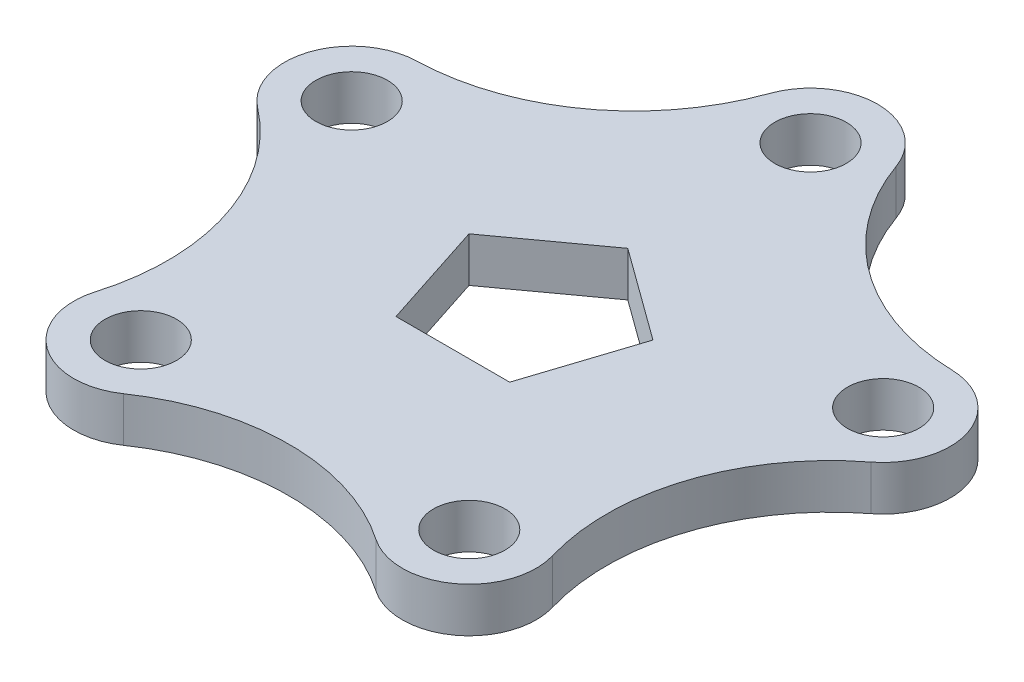
ISO-10303-21;
HEADER;
FILE_DESCRIPTION(('STEP AP214'),'2;1');
FILE_NAME('part.step','',(''),(''),'','','');
FILE_SCHEMA(('AUTOMOTIVE_DESIGN { 1 0 10303 214 1 1 1 1 }'));
ENDSEC;
DATA;
#1=APPLICATION_CONTEXT('core data for automotive mechanical design processes');
#2=APPLICATION_PROTOCOL_DEFINITION('international standard','automotive_design',2000,#1);
#3=PRODUCT_CONTEXT('',#1,'mechanical');
#4=PRODUCT('Part','Part','',(#3));
#5=PRODUCT_RELATED_PRODUCT_CATEGORY('part','',(#4));
#6=PRODUCT_DEFINITION_FORMATION('','',#4);
#7=PRODUCT_DEFINITION_CONTEXT('part definition',#1,'design');
#8=PRODUCT_DEFINITION('design','',#6,#7);
#9=PRODUCT_DEFINITION_SHAPE('','',#8);
#10=(LENGTH_UNIT() NAMED_UNIT(*) SI_UNIT(.MILLI.,.METRE.));
#11=(NAMED_UNIT(*) PLANE_ANGLE_UNIT() SI_UNIT($,.RADIAN.));
#12=(NAMED_UNIT(*) SI_UNIT($,.STERADIAN.) SOLID_ANGLE_UNIT());
#13=UNCERTAINTY_MEASURE_WITH_UNIT(LENGTH_MEASURE(1.E-05),#10,'distance_accuracy_value','');
#14=(GEOMETRIC_REPRESENTATION_CONTEXT(3) GLOBAL_UNCERTAINTY_ASSIGNED_CONTEXT((#13)) GLOBAL_UNIT_ASSIGNED_CONTEXT((#10,
#11,#12)) REPRESENTATION_CONTEXT('',''));
#15=CARTESIAN_POINT('',(0.,0.,0.));
#16=DIRECTION('',(0.,0.,1.));
#17=DIRECTION('',(1.,0.,0.));
#18=AXIS2_PLACEMENT_3D('',#15,#16,#17);
#19=CARTESIAN_POINT('',(60.340172157842,5.,-51.8011220361711));
#20=DIRECTION('',(0.,1.,0.));
#21=DIRECTION('',(0.,0.,1.));
#22=AXIS2_PLACEMENT_3D('',#19,#20,#21);
#23=PLANE('',#22);
#24=CARTESIAN_POINT('',(-36.73657826828,5.,50.5635621484339));
#25=DIRECTION('',(0.,1.,0.));
#26=DIRECTION('',(0.,0.,1.));
#27=AXIS2_PLACEMENT_3D('',#24,#25,#26);
#28=CIRCLE('',#27,8.00000000000001);
#29=CARTESIAN_POINT('',(-36.73657826828,5.,58.5635621484339));
#30=VERTEX_POINT('',#29);
#31=EDGE_CURVE('E618',#30,#30,#28,.T.);
#32=ORIENTED_EDGE('',*,*,#31,.F.);
#33=EDGE_LOOP('',(#32));
#34=FACE_BOUND('',#33,.T.);
#35=CARTESIAN_POINT('',(59.4410322684472,5.,-19.313562148434));
#36=DIRECTION('',(0.,1.,0.));
#37=DIRECTION('',(0.,0.,1.));
#38=AXIS2_PLACEMENT_3D('',#35,#36,#37);
#39=CIRCLE('',#38,8.00000000000001);
#40=CARTESIAN_POINT('',(59.4410322684472,5.,-11.313562148434));
#41=VERTEX_POINT('',#40);
#42=EDGE_CURVE('E190',#41,#41,#39,.T.);
#43=ORIENTED_EDGE('',*,*,#42,.F.);
#44=EDGE_LOOP('',(#43));
#45=FACE_BOUND('',#44,.T.);
#46=CARTESIAN_POINT('',(61.2393120472368,5.,-84.2886819239081));
#47=DIRECTION('',(0.,-1.,0.));
#48=DIRECTION('',(0.,0.,1.));
#49=AXIS2_PLACEMENT_3D('',#46,#47,#48);
#50=CIRCLE('',#49,50.0000000000003);
#51=CARTESIAN_POINT('',(59.8560199097063,5.,-34.3078205581589));
#52=VERTEX_POINT('',#51);
#53=CARTESIAN_POINT('',(14.1321489339776,5.,-67.5281573670557));
#54=VERTEX_POINT('',#53);
#55=EDGE_CURVE('E221',#52,#54,#50,.T.);
#56=ORIENTED_EDGE('',*,*,#55,.T.);
#57=CARTESIAN_POINT('',(0.,5.,-62.5));
#58=DIRECTION('',(0.,1.,0.));
#59=DIRECTION('',(0.,0.,1.));
#60=AXIS2_PLACEMENT_3D('',#57,#58,#59);
#61=CIRCLE('',#60,15.0000000000001);
#62=CARTESIAN_POINT('',(-14.1321489339776,5.,-67.5281573670559));
#63=VERTEX_POINT('',#62);
#64=EDGE_CURVE('E225',#54,#63,#61,.T.);
#65=ORIENTED_EDGE('',*,*,#64,.T.);
#66=CARTESIAN_POINT('',(-61.2393120472359,5.,-84.2886819239087));
#67=DIRECTION('',(0.,-1.,0.));
#68=DIRECTION('',(0.,0.,1.));
#69=AXIS2_PLACEMENT_3D('',#66,#67,#68);
#70=CIRCLE('',#69,49.9999999999999);
#71=CARTESIAN_POINT('',(-59.8560199097059,5.,-34.3078205581597));
#72=VERTEX_POINT('',#71);
#73=EDGE_CURVE('E229',#63,#72,#70,.T.);
#74=ORIENTED_EDGE('',*,*,#73,.T.);
#75=CARTESIAN_POINT('',(-59.4410322684469,5.,-19.3135621484349));
#76=DIRECTION('',(0.,1.,0.));
#77=DIRECTION('',(0.,0.,1.));
#78=AXIS2_PLACEMENT_3D('',#75,#76,#77);
#79=CIRCLE('',#78,15.);
#80=CARTESIAN_POINT('',(-68.5901682849797,5.,-7.4268758923341));
#81=VERTEX_POINT('',#80);
#82=EDGE_CURVE('E232',#72,#81,#79,.T.);
#83=ORIENTED_EDGE('',*,*,#82,.T.);
#84=CARTESIAN_POINT('',(-99.0872883400896,5.,32.1954116280026));
#85=DIRECTION('',(0.,-1.,0.));
#86=DIRECTION('',(0.,0.,1.));
#87=AXIS2_PLACEMENT_3D('',#84,#85,#86);
#88=CIRCLE('',#87,50.0000000000002);
#89=CARTESIAN_POINT('',(-51.1252036694668,5.,46.3247581821805));
#90=VERTEX_POINT('',#89);
#91=EDGE_CURVE('E235',#81,#90,#88,.T.);
#92=ORIENTED_EDGE('',*,*,#91,.T.);
#93=CARTESIAN_POINT('',(-36.73657826828,5.,50.5635621484339));
#94=DIRECTION('',(0.,1.,0.));
#95=DIRECTION('',(0.,0.,1.));
#96=AXIS2_PLACEMENT_3D('',#93,#94,#95);
#97=CIRCLE('',#96,15.0000000000001);
#98=CARTESIAN_POINT('',(-28.2589063602158,5.,62.9380956353663));
#99=VERTEX_POINT('',#98);
#100=EDGE_CURVE('E238',#90,#99,#97,.T.);
#101=ORIENTED_EDGE('',*,*,#100,.T.);
#102=CARTESIAN_POINT('',(-1.31838984174237E-12,5.,104.186540591809));
#103=DIRECTION('',(0.,-1.,0.));
#104=DIRECTION('',(0.,0.,1.));
#105=AXIS2_PLACEMENT_3D('',#102,#103,#104);
#106=CIRCLE('',#105,50.0000000000002);
#107=CARTESIAN_POINT('',(28.2589063602146,5.,62.9380956353669));
#108=VERTEX_POINT('',#107);
#109=EDGE_CURVE('E241',#99,#108,#106,.T.);
#110=ORIENTED_EDGE('',*,*,#109,.T.);
#111=CARTESIAN_POINT('',(36.7365782682793,5.,50.5635621484344));
#112=DIRECTION('',(0.,1.,0.));
#113=DIRECTION('',(0.,0.,1.));
#114=AXIS2_PLACEMENT_3D('',#111,#112,#113);
#115=CIRCLE('',#114,15.0000000000001);
#116=CARTESIAN_POINT('',(51.1252036694658,5.,46.3247581821816));
#117=VERTEX_POINT('',#116);
#118=EDGE_CURVE('E244',#108,#117,#115,.T.);
#119=ORIENTED_EDGE('',*,*,#118,.T.);
#120=CARTESIAN_POINT('',(99.0872883400888,5.,32.1954116280051));
#121=DIRECTION('',(0.,-1.,0.));
#122=DIRECTION('',(0.,0.,1.));
#123=AXIS2_PLACEMENT_3D('',#120,#121,#122);
#124=CIRCLE('',#123,50.0000000000002);
#125=CARTESIAN_POINT('',(68.5901682849798,5.,-7.42687589233277));
#126=VERTEX_POINT('',#125);
#127=EDGE_CURVE('E247',#117,#126,#124,.T.);
#128=ORIENTED_EDGE('',*,*,#127,.T.);
#129=CARTESIAN_POINT('',(59.4410322684472,5.,-19.313562148434));
#130=DIRECTION('',(0.,1.,0.));
#131=DIRECTION('',(0.,0.,1.));
#132=AXIS2_PLACEMENT_3D('',#129,#130,#131);
#133=CIRCLE('',#132,15.0000000000001);
#134=EDGE_CURVE('E250',#126,#52,#133,.T.);
#135=ORIENTED_EDGE('',*,*,#134,.T.);
#136=EDGE_LOOP('',(#56,#65,#74,#83,#92,#101,#110,#119,#128,#135));
#137=FACE_BOUND('',#136,.T.);
#138=CARTESIAN_POINT('',(0.,5.,-62.5));
#139=DIRECTION('',(0.,1.,0.));
#140=DIRECTION('',(0.,0.,1.));
#141=AXIS2_PLACEMENT_3D('',#138,#139,#140);
#142=CIRCLE('',#141,8.);
#143=CARTESIAN_POINT('',(0.,5.,-54.5));
#144=VERTEX_POINT('',#143);
#145=EDGE_CURVE('E213',#144,#144,#142,.T.);
#146=ORIENTED_EDGE('',*,*,#145,.F.);
#147=EDGE_LOOP('',(#146));
#148=FACE_BOUND('',#147,.T.);
#149=DIRECTION('',(-0.809016994374947,0.,0.587785252292473));
#150=VECTOR('',#149,1.);
#151=CARTESIAN_POINT('',(0.,5.,-21.6311896062463));
#152=LINE('',#151,#150);
#153=CARTESIAN_POINT('',(0.,5.,-21.6311896062463));
#154=VERTEX_POINT('',#153);
#155=CARTESIAN_POINT('',(-20.5724838302366,5.,-6.68440519687684));
#156=VERTEX_POINT('',#155);
#157=EDGE_CURVE('E160',#154,#156,#152,.T.);
#158=ORIENTED_EDGE('',*,*,#157,.F.);
#159=DIRECTION('',(-0.809016994374947,0.,-0.587785252292473));
#160=VECTOR('',#159,1.);
#161=CARTESIAN_POINT('',(20.5724838302366,5.,-6.68440519687684));
#162=LINE('',#161,#160);
#163=CARTESIAN_POINT('',(20.5724838302366,5.,-6.68440519687684));
#164=VERTEX_POINT('',#163);
#165=EDGE_CURVE('E151',#164,#154,#162,.T.);
#166=ORIENTED_EDGE('',*,*,#165,.F.);
#167=DIRECTION('',(0.309016994374948,0.,-0.951056516295154));
#168=VECTOR('',#167,1.);
#169=CARTESIAN_POINT('',(12.7144942400938,5.,17.5));
#170=LINE('',#169,#168);
#171=CARTESIAN_POINT('',(12.7144942400938,5.,17.5));
#172=VERTEX_POINT('',#171);
#173=EDGE_CURVE('E185',#172,#164,#170,.T.);
#174=ORIENTED_EDGE('',*,*,#173,.F.);
#175=DIRECTION('',(1.,0.,0.));
#176=VECTOR('',#175,1.);
#177=CARTESIAN_POINT('',(-12.7144942400938,5.,17.5));
#178=LINE('',#177,#176);
#179=CARTESIAN_POINT('',(-12.7144942400938,5.,17.5));
#180=VERTEX_POINT('',#179);
#181=EDGE_CURVE('E179',#180,#172,#178,.T.);
#182=ORIENTED_EDGE('',*,*,#181,.F.);
#183=DIRECTION('',(0.309016994374948,0.,0.951056516295154));
#184=VECTOR('',#183,1.);
#185=CARTESIAN_POINT('',(-20.5724838302366,5.,-6.68440519687684));
#186=LINE('',#185,#184);
#187=EDGE_CURVE('E175',#156,#180,#186,.T.);
#188=ORIENTED_EDGE('',*,*,#187,.F.);
#189=EDGE_LOOP('',(#158,#166,#174,#182,#188));
#190=FACE_BOUND('',#189,.T.);
#191=CARTESIAN_POINT('',(36.7365782682793,5.,50.5635621484344));
#192=DIRECTION('',(0.,1.,0.));
#193=DIRECTION('',(0.,0.,1.));
#194=AXIS2_PLACEMENT_3D('',#191,#192,#193);
#195=CIRCLE('',#194,8.);
#196=CARTESIAN_POINT('',(36.7365782682793,5.,58.5635621484344));
#197=VERTEX_POINT('',#196);
#198=EDGE_CURVE('E626',#197,#197,#195,.T.);
#199=ORIENTED_EDGE('',*,*,#198,.F.);
#200=EDGE_LOOP('',(#199));
#201=FACE_BOUND('',#200,.T.);
#202=CARTESIAN_POINT('',(-59.4410322684469,5.,-19.3135621484349));
#203=DIRECTION('',(0.,1.,0.));
#204=DIRECTION('',(0.,0.,1.));
#205=AXIS2_PLACEMENT_3D('',#202,#203,#204);
#206=CIRCLE('',#205,8.);
#207=CARTESIAN_POINT('',(-59.4410322684469,5.,-11.3135621484349));
#208=VERTEX_POINT('',#207);
#209=EDGE_CURVE('E607',#208,#208,#206,.T.);
#210=ORIENTED_EDGE('',*,*,#209,.F.);
#211=EDGE_LOOP('',(#210));
#212=FACE_BOUND('',#211,.T.);
#213=ADVANCED_FACE('F43',(#34,#45,#137,#148,#190,#201,#212),#23,.T.);
#214=CARTESIAN_POINT('',(60.340172157842,-5.,-51.8011220361711));
#215=DIRECTION('',(0.,1.,0.));
#216=DIRECTION('',(0.,0.,1.));
#217=AXIS2_PLACEMENT_3D('',#214,#215,#216);
#218=PLANE('',#217);
#219=CARTESIAN_POINT('',(0.,-5.,-62.5));
#220=DIRECTION('',(0.,1.,0.));
#221=DIRECTION('',(0.,0.,1.));
#222=AXIS2_PLACEMENT_3D('',#219,#220,#221);
#223=CIRCLE('',#222,8.);
#224=CARTESIAN_POINT('',(0.,-5.,-54.5));
#225=VERTEX_POINT('',#224);
#226=EDGE_CURVE('E169',#225,#225,#223,.T.);
#227=ORIENTED_EDGE('',*,*,#226,.T.);
#228=EDGE_LOOP('',(#227));
#229=FACE_BOUND('',#228,.T.);
#230=CARTESIAN_POINT('',(61.2393120472368,-5.,-84.2886819239081));
#231=DIRECTION('',(0.,-1.,0.));
#232=DIRECTION('',(0.,0.,1.));
#233=AXIS2_PLACEMENT_3D('',#230,#231,#232);
#234=CIRCLE('',#233,50.0000000000003);
#235=CARTESIAN_POINT('',(59.8560199097063,-5.,-34.3078205581589));
#236=VERTEX_POINT('',#235);
#237=CARTESIAN_POINT('',(14.1321489339776,-5.,-67.5281573670557));
#238=VERTEX_POINT('',#237);
#239=EDGE_CURVE('E217',#236,#238,#234,.T.);
#240=ORIENTED_EDGE('',*,*,#239,.F.);
#241=CARTESIAN_POINT('',(59.4410322684472,-5.,-19.313562148434));
#242=DIRECTION('',(0.,1.,0.));
#243=DIRECTION('',(0.,0.,1.));
#244=AXIS2_PLACEMENT_3D('',#241,#242,#243);
#245=CIRCLE('',#244,15.0000000000001);
#246=CARTESIAN_POINT('',(68.5901682849798,-5.,-7.42687589233277));
#247=VERTEX_POINT('',#246);
#248=EDGE_CURVE('E226',#247,#236,#245,.T.);
#249=ORIENTED_EDGE('',*,*,#248,.F.);
#250=CARTESIAN_POINT('',(99.0872883400888,-5.,32.1954116280051));
#251=DIRECTION('',(0.,-1.,0.));
#252=DIRECTION('',(0.,0.,1.));
#253=AXIS2_PLACEMENT_3D('',#250,#251,#252);
#254=CIRCLE('',#253,50.0000000000002);
#255=CARTESIAN_POINT('',(51.1252036694658,-5.,46.3247581821816));
#256=VERTEX_POINT('',#255);
#257=EDGE_CURVE('E278',#256,#247,#254,.T.);
#258=ORIENTED_EDGE('',*,*,#257,.F.);
#259=CARTESIAN_POINT('',(36.7365782682793,-5.,50.5635621484344));
#260=DIRECTION('',(0.,1.,0.));
#261=DIRECTION('',(0.,0.,1.));
#262=AXIS2_PLACEMENT_3D('',#259,#260,#261);
#263=CIRCLE('',#262,15.0000000000001);
#264=CARTESIAN_POINT('',(28.2589063602146,-5.,62.9380956353669));
#265=VERTEX_POINT('',#264);
#266=EDGE_CURVE('E275',#265,#256,#263,.T.);
#267=ORIENTED_EDGE('',*,*,#266,.F.);
#268=CARTESIAN_POINT('',(-1.31838984174237E-12,-5.,104.186540591809));
#269=DIRECTION('',(0.,-1.,0.));
#270=DIRECTION('',(0.,0.,1.));
#271=AXIS2_PLACEMENT_3D('',#268,#269,#270);
#272=CIRCLE('',#271,50.0000000000002);
#273=CARTESIAN_POINT('',(-28.2589063602158,-5.,62.9380956353663));
#274=VERTEX_POINT('',#273);
#275=EDGE_CURVE('E272',#274,#265,#272,.T.);
#276=ORIENTED_EDGE('',*,*,#275,.F.);
#277=CARTESIAN_POINT('',(-36.73657826828,-5.,50.5635621484339));
#278=DIRECTION('',(0.,1.,0.));
#279=DIRECTION('',(0.,0.,1.));
#280=AXIS2_PLACEMENT_3D('',#277,#278,#279);
#281=CIRCLE('',#280,15.0000000000001);
#282=CARTESIAN_POINT('',(-51.1252036694668,-5.,46.3247581821805));
#283=VERTEX_POINT('',#282);
#284=EDGE_CURVE('E269',#283,#274,#281,.T.);
#285=ORIENTED_EDGE('',*,*,#284,.F.);
#286=CARTESIAN_POINT('',(-99.0872883400896,-5.,32.1954116280026));
#287=DIRECTION('',(0.,-1.,0.));
#288=DIRECTION('',(0.,0.,1.));
#289=AXIS2_PLACEMENT_3D('',#286,#287,#288);
#290=CIRCLE('',#289,50.0000000000002);
#291=CARTESIAN_POINT('',(-68.5901682849797,-5.,-7.4268758923341));
#292=VERTEX_POINT('',#291);
#293=EDGE_CURVE('E266',#292,#283,#290,.T.);
#294=ORIENTED_EDGE('',*,*,#293,.F.);
#295=CARTESIAN_POINT('',(-59.4410322684469,-5.,-19.3135621484349));
#296=DIRECTION('',(0.,1.,0.));
#297=DIRECTION('',(0.,0.,1.));
#298=AXIS2_PLACEMENT_3D('',#295,#296,#297);
#299=CIRCLE('',#298,15.);
#300=CARTESIAN_POINT('',(-59.8560199097059,-5.,-34.3078205581597));
#301=VERTEX_POINT('',#300);
#302=EDGE_CURVE('E263',#301,#292,#299,.T.);
#303=ORIENTED_EDGE('',*,*,#302,.F.);
#304=CARTESIAN_POINT('',(-61.2393120472359,-5.,-84.2886819239087));
#305=DIRECTION('',(0.,-1.,0.));
#306=DIRECTION('',(0.,0.,1.));
#307=AXIS2_PLACEMENT_3D('',#304,#305,#306);
#308=CIRCLE('',#307,49.9999999999999);
#309=CARTESIAN_POINT('',(-14.1321489339776,-5.,-67.5281573670559));
#310=VERTEX_POINT('',#309);
#311=EDGE_CURVE('E260',#310,#301,#308,.T.);
#312=ORIENTED_EDGE('',*,*,#311,.F.);
#313=CARTESIAN_POINT('',(0.,-5.,-62.5));
#314=DIRECTION('',(0.,1.,0.));
#315=DIRECTION('',(0.,0.,1.));
#316=AXIS2_PLACEMENT_3D('',#313,#314,#315);
#317=CIRCLE('',#316,15.0000000000001);
#318=EDGE_CURVE('E257',#238,#310,#317,.T.);
#319=ORIENTED_EDGE('',*,*,#318,.F.);
#320=EDGE_LOOP('',(#240,#249,#258,#267,#276,#285,#294,#303,#312,#319));
#321=FACE_BOUND('',#320,.T.);
#322=DIRECTION('',(-0.809016994374947,0.,-0.587785252292473));
#323=VECTOR('',#322,1.);
#324=CARTESIAN_POINT('',(20.5724838302366,-5.,-6.68440519687684));
#325=LINE('',#324,#323);
#326=CARTESIAN_POINT('',(20.5724838302366,-5.,-6.68440519687684));
#327=VERTEX_POINT('',#326);
#328=CARTESIAN_POINT('',(0.,-5.,-21.6311896062463));
#329=VERTEX_POINT('',#328);
#330=EDGE_CURVE('E67',#327,#329,#325,.T.);
#331=ORIENTED_EDGE('',*,*,#330,.T.);
#332=DIRECTION('',(-0.809016994374947,0.,0.587785252292473));
#333=VECTOR('',#332,1.);
#334=CARTESIAN_POINT('',(0.,-5.,-21.6311896062463));
#335=LINE('',#334,#333);
#336=CARTESIAN_POINT('',(-20.5724838302366,-5.,-6.68440519687684));
#337=VERTEX_POINT('',#336);
#338=EDGE_CURVE('E167',#329,#337,#335,.T.);
#339=ORIENTED_EDGE('',*,*,#338,.T.);
#340=DIRECTION('',(0.309016994374948,0.,0.951056516295154));
#341=VECTOR('',#340,1.);
#342=CARTESIAN_POINT('',(-20.5724838302366,-5.,-6.68440519687684));
#343=LINE('',#342,#341);
#344=CARTESIAN_POINT('',(-12.7144942400938,-5.,17.5));
#345=VERTEX_POINT('',#344);
#346=EDGE_CURVE('E193',#337,#345,#343,.T.);
#347=ORIENTED_EDGE('',*,*,#346,.T.);
#348=DIRECTION('',(1.,0.,0.));
#349=VECTOR('',#348,1.);
#350=CARTESIAN_POINT('',(-12.7144942400938,-5.,17.5));
#351=LINE('',#350,#349);
#352=CARTESIAN_POINT('',(12.7144942400938,-5.,17.5));
#353=VERTEX_POINT('',#352);
#354=EDGE_CURVE('E197',#345,#353,#351,.T.);
#355=ORIENTED_EDGE('',*,*,#354,.T.);
#356=DIRECTION('',(0.309016994374948,0.,-0.951056516295154));
#357=VECTOR('',#356,1.);
#358=CARTESIAN_POINT('',(12.7144942400938,-5.,17.5));
#359=LINE('',#358,#357);
#360=EDGE_CURVE('E161',#353,#327,#359,.T.);
#361=ORIENTED_EDGE('',*,*,#360,.T.);
#362=EDGE_LOOP('',(#331,#339,#347,#355,#361));
#363=FACE_BOUND('',#362,.T.);
#364=CARTESIAN_POINT('',(59.4410322684472,-5.,-19.313562148434));
#365=DIRECTION('',(0.,1.,0.));
#366=DIRECTION('',(0.,0.,1.));
#367=AXIS2_PLACEMENT_3D('',#364,#365,#366);
#368=CIRCLE('',#367,8.00000000000001);
#369=CARTESIAN_POINT('',(59.4410322684472,-5.,-11.313562148434));
#370=VERTEX_POINT('',#369);
#371=EDGE_CURVE('E630',#370,#370,#368,.T.);
#372=ORIENTED_EDGE('',*,*,#371,.T.);
#373=EDGE_LOOP('',(#372));
#374=FACE_BOUND('',#373,.T.);
#375=CARTESIAN_POINT('',(36.7365782682793,-5.,50.5635621484344));
#376=DIRECTION('',(0.,1.,0.));
#377=DIRECTION('',(0.,0.,1.));
#378=AXIS2_PLACEMENT_3D('',#375,#376,#377);
#379=CIRCLE('',#378,8.);
#380=CARTESIAN_POINT('',(36.7365782682793,-5.,58.5635621484344));
#381=VERTEX_POINT('',#380);
#382=EDGE_CURVE('E622',#381,#381,#379,.T.);
#383=ORIENTED_EDGE('',*,*,#382,.T.);
#384=EDGE_LOOP('',(#383));
#385=FACE_BOUND('',#384,.T.);
#386=CARTESIAN_POINT('',(-36.73657826828,-5.,50.5635621484339));
#387=DIRECTION('',(0.,1.,0.));
#388=DIRECTION('',(0.,0.,1.));
#389=AXIS2_PLACEMENT_3D('',#386,#387,#388);
#390=CIRCLE('',#389,8.00000000000001);
#391=CARTESIAN_POINT('',(-36.73657826828,-5.,58.5635621484339));
#392=VERTEX_POINT('',#391);
#393=EDGE_CURVE('E615',#392,#392,#390,.T.);
#394=ORIENTED_EDGE('',*,*,#393,.T.);
#395=EDGE_LOOP('',(#394));
#396=FACE_BOUND('',#395,.T.);
#397=CARTESIAN_POINT('',(-59.4410322684469,-5.,-19.3135621484349));
#398=DIRECTION('',(0.,1.,0.));
#399=DIRECTION('',(0.,0.,1.));
#400=AXIS2_PLACEMENT_3D('',#397,#398,#399);
#401=CIRCLE('',#400,8.);
#402=CARTESIAN_POINT('',(-59.4410322684469,-5.,-11.3135621484349));
#403=VERTEX_POINT('',#402);
#404=EDGE_CURVE('E610',#403,#403,#401,.T.);
#405=ORIENTED_EDGE('',*,*,#404,.T.);
#406=EDGE_LOOP('',(#405));
#407=FACE_BOUND('',#406,.T.);
#408=ADVANCED_FACE('F325',(#229,#321,#363,#374,#385,#396,#407),#218,.F.);
#409=CARTESIAN_POINT('',(61.2393120472368,5.,-84.2886819239081));
#410=DIRECTION('',(0.,-1.,0.));
#411=DIRECTION('',(0.,0.,-1.));
#412=AXIS2_PLACEMENT_3D('',#409,#410,#411);
#413=CYLINDRICAL_SURFACE('',#412,50.0000000000003);
#414=ORIENTED_EDGE('',*,*,#239,.T.);
#415=DIRECTION('',(0.,-1.,0.));
#416=VECTOR('',#415,1.);
#417=CARTESIAN_POINT('',(14.1321489339776,5.,-67.5281573670557));
#418=LINE('',#417,#416);
#419=EDGE_CURVE('E11',#54,#238,#418,.T.);
#420=ORIENTED_EDGE('',*,*,#419,.F.);
#421=ORIENTED_EDGE('',*,*,#55,.F.);
#422=DIRECTION('',(0.,-1.,0.));
#423=VECTOR('',#422,1.);
#424=CARTESIAN_POINT('',(59.8560199097063,5.,-34.3078205581589));
#425=LINE('',#424,#423);
#426=EDGE_CURVE('E253',#52,#236,#425,.T.);
#427=ORIENTED_EDGE('',*,*,#426,.T.);
#428=EDGE_LOOP('',(#414,#420,#421,#427));
#429=FACE_BOUND('',#428,.T.);
#430=ADVANCED_FACE('F45',(#429),#413,.F.);
#431=CARTESIAN_POINT('',(0.,5.,-62.5));
#432=DIRECTION('',(0.,-1.,0.));
#433=DIRECTION('',(0.,0.,-1.));
#434=AXIS2_PLACEMENT_3D('',#431,#432,#433);
#435=CYLINDRICAL_SURFACE('',#434,15.0000000000001);
#436=ORIENTED_EDGE('',*,*,#318,.T.);
#437=DIRECTION('',(0.,-1.,0.));
#438=VECTOR('',#437,1.);
#439=CARTESIAN_POINT('',(-14.1321489339776,5.,-67.5281573670559));
#440=LINE('',#439,#438);
#441=EDGE_CURVE('E52',#63,#310,#440,.T.);
#442=ORIENTED_EDGE('',*,*,#441,.F.);
#443=ORIENTED_EDGE('',*,*,#64,.F.);
#444=ORIENTED_EDGE('',*,*,#419,.T.);
#445=EDGE_LOOP('',(#436,#442,#443,#444));
#446=FACE_BOUND('',#445,.T.);
#447=ADVANCED_FACE('F343',(#446),#435,.T.);
#448=CARTESIAN_POINT('',(-61.2393120472359,5.,-84.2886819239087));
#449=DIRECTION('',(0.,-1.,0.));
#450=DIRECTION('',(0.,0.,-1.));
#451=AXIS2_PLACEMENT_3D('',#448,#449,#450);
#452=CYLINDRICAL_SURFACE('',#451,49.9999999999999);
#453=ORIENTED_EDGE('',*,*,#311,.T.);
#454=DIRECTION('',(0.,-1.,0.));
#455=VECTOR('',#454,1.);
#456=CARTESIAN_POINT('',(-59.8560199097059,5.,-34.3078205581597));
#457=LINE('',#456,#455);
#458=EDGE_CURVE('E310',#72,#301,#457,.T.);
#459=ORIENTED_EDGE('',*,*,#458,.F.);
#460=ORIENTED_EDGE('',*,*,#73,.F.);
#461=ORIENTED_EDGE('',*,*,#441,.T.);
#462=EDGE_LOOP('',(#453,#459,#460,#461));
#463=FACE_BOUND('',#462,.T.);
#464=ADVANCED_FACE('F319',(#463),#452,.F.);
#465=CARTESIAN_POINT('',(-59.4410322684469,5.,-19.3135621484349));
#466=DIRECTION('',(0.,-1.,0.));
#467=DIRECTION('',(0.,0.,-1.));
#468=AXIS2_PLACEMENT_3D('',#465,#466,#467);
#469=CYLINDRICAL_SURFACE('',#468,15.);
#470=ORIENTED_EDGE('',*,*,#302,.T.);
#471=DIRECTION('',(0.,-1.,0.));
#472=VECTOR('',#471,1.);
#473=CARTESIAN_POINT('',(-68.5901682849797,5.,-7.4268758923341));
#474=LINE('',#473,#472);
#475=EDGE_CURVE('E306',#81,#292,#474,.T.);
#476=ORIENTED_EDGE('',*,*,#475,.F.);
#477=ORIENTED_EDGE('',*,*,#82,.F.);
#478=ORIENTED_EDGE('',*,*,#458,.T.);
#479=EDGE_LOOP('',(#470,#476,#477,#478));
#480=FACE_BOUND('',#479,.T.);
#481=ADVANCED_FACE('F331',(#480),#469,.T.);
#482=CARTESIAN_POINT('',(-99.0872883400896,5.,32.1954116280026));
#483=DIRECTION('',(0.,-1.,0.));
#484=DIRECTION('',(0.,0.,-1.));
#485=AXIS2_PLACEMENT_3D('',#482,#483,#484);
#486=CYLINDRICAL_SURFACE('',#485,50.0000000000002);
#487=ORIENTED_EDGE('',*,*,#293,.T.);
#488=DIRECTION('',(0.,-1.,0.));
#489=VECTOR('',#488,1.);
#490=CARTESIAN_POINT('',(-51.1252036694668,5.,46.3247581821805));
#491=LINE('',#490,#489);
#492=EDGE_CURVE('E302',#90,#283,#491,.T.);
#493=ORIENTED_EDGE('',*,*,#492,.F.);
#494=ORIENTED_EDGE('',*,*,#91,.F.);
#495=ORIENTED_EDGE('',*,*,#475,.T.);
#496=EDGE_LOOP('',(#487,#493,#494,#495));
#497=FACE_BOUND('',#496,.T.);
#498=ADVANCED_FACE('F335',(#497),#486,.F.);
#499=CARTESIAN_POINT('',(-36.73657826828,5.,50.5635621484339));
#500=DIRECTION('',(0.,-1.,0.));
#501=DIRECTION('',(0.,0.,-1.));
#502=AXIS2_PLACEMENT_3D('',#499,#500,#501);
#503=CYLINDRICAL_SURFACE('',#502,15.0000000000001);
#504=ORIENTED_EDGE('',*,*,#284,.T.);
#505=DIRECTION('',(0.,-1.,0.));
#506=VECTOR('',#505,1.);
#507=CARTESIAN_POINT('',(-28.2589063602158,5.,62.9380956353663));
#508=LINE('',#507,#506);
#509=EDGE_CURVE('E298',#99,#274,#508,.T.);
#510=ORIENTED_EDGE('',*,*,#509,.F.);
#511=ORIENTED_EDGE('',*,*,#100,.F.);
#512=ORIENTED_EDGE('',*,*,#492,.T.);
#513=EDGE_LOOP('',(#504,#510,#511,#512));
#514=FACE_BOUND('',#513,.T.);
#515=ADVANCED_FACE('F366',(#514),#503,.T.);
#516=CARTESIAN_POINT('',(-1.31838984174237E-12,5.,104.186540591809));
#517=DIRECTION('',(0.,-1.,0.));
#518=DIRECTION('',(0.,0.,-1.));
#519=AXIS2_PLACEMENT_3D('',#516,#517,#518);
#520=CYLINDRICAL_SURFACE('',#519,50.0000000000002);
#521=ORIENTED_EDGE('',*,*,#275,.T.);
#522=DIRECTION('',(0.,-1.,0.));
#523=VECTOR('',#522,1.);
#524=CARTESIAN_POINT('',(28.2589063602146,5.,62.9380956353669));
#525=LINE('',#524,#523);
#526=EDGE_CURVE('E294',#108,#265,#525,.T.);
#527=ORIENTED_EDGE('',*,*,#526,.F.);
#528=ORIENTED_EDGE('',*,*,#109,.F.);
#529=ORIENTED_EDGE('',*,*,#509,.T.);
#530=EDGE_LOOP('',(#521,#527,#528,#529));
#531=FACE_BOUND('',#530,.T.);
#532=ADVANCED_FACE('F363',(#531),#520,.F.);
#533=CARTESIAN_POINT('',(36.7365782682793,5.,50.5635621484344));
#534=DIRECTION('',(0.,-1.,0.));
#535=DIRECTION('',(0.,0.,-1.));
#536=AXIS2_PLACEMENT_3D('',#533,#534,#535);
#537=CYLINDRICAL_SURFACE('',#536,15.0000000000001);
#538=ORIENTED_EDGE('',*,*,#266,.T.);
#539=DIRECTION('',(0.,-1.,0.));
#540=VECTOR('',#539,1.);
#541=CARTESIAN_POINT('',(51.1252036694658,5.,46.3247581821816));
#542=LINE('',#541,#540);
#543=EDGE_CURVE('E290',#117,#256,#542,.T.);
#544=ORIENTED_EDGE('',*,*,#543,.F.);
#545=ORIENTED_EDGE('',*,*,#118,.F.);
#546=ORIENTED_EDGE('',*,*,#526,.T.);
#547=EDGE_LOOP('',(#538,#544,#545,#546));
#548=FACE_BOUND('',#547,.T.);
#549=ADVANCED_FACE('F359',(#548),#537,.T.);
#550=CARTESIAN_POINT('',(99.0872883400888,5.,32.1954116280051));
#551=DIRECTION('',(0.,-1.,0.));
#552=DIRECTION('',(0.,0.,-1.));
#553=AXIS2_PLACEMENT_3D('',#550,#551,#552);
#554=CYLINDRICAL_SURFACE('',#553,50.0000000000002);
#555=ORIENTED_EDGE('',*,*,#257,.T.);
#556=DIRECTION('',(0.,-1.,0.));
#557=VECTOR('',#556,1.);
#558=CARTESIAN_POINT('',(68.5901682849798,5.,-7.42687589233277));
#559=LINE('',#558,#557);
#560=EDGE_CURVE('E286',#126,#247,#559,.T.);
#561=ORIENTED_EDGE('',*,*,#560,.F.);
#562=ORIENTED_EDGE('',*,*,#127,.F.);
#563=ORIENTED_EDGE('',*,*,#543,.T.);
#564=EDGE_LOOP('',(#555,#561,#562,#563));
#565=FACE_BOUND('',#564,.T.);
#566=ADVANCED_FACE('F355',(#565),#554,.F.);
#567=CARTESIAN_POINT('',(59.4410322684472,5.,-19.313562148434));
#568=DIRECTION('',(0.,-1.,0.));
#569=DIRECTION('',(0.,0.,-1.));
#570=AXIS2_PLACEMENT_3D('',#567,#568,#569);
#571=CYLINDRICAL_SURFACE('',#570,15.0000000000001);
#572=ORIENTED_EDGE('',*,*,#248,.T.);
#573=ORIENTED_EDGE('',*,*,#426,.F.);
#574=ORIENTED_EDGE('',*,*,#134,.F.);
#575=ORIENTED_EDGE('',*,*,#560,.T.);
#576=EDGE_LOOP('',(#572,#573,#574,#575));
#577=FACE_BOUND('',#576,.T.);
#578=ADVANCED_FACE('F350',(#577),#571,.T.);
#579=CARTESIAN_POINT('',(0.,5.,-62.5));
#580=DIRECTION('',(0.,-1.,0.));
#581=DIRECTION('',(0.,0.,-1.));
#582=AXIS2_PLACEMENT_3D('',#579,#580,#581);
#583=CYLINDRICAL_SURFACE('',#582,8.);
#584=ORIENTED_EDGE('',*,*,#145,.T.);
#585=EDGE_LOOP('',(#584));
#586=FACE_BOUND('',#585,.T.);
#587=ORIENTED_EDGE('',*,*,#226,.F.);
#588=EDGE_LOOP('',(#587));
#589=FACE_BOUND('',#588,.T.);
#590=ADVANCED_FACE('F386',(#586,#589),#583,.F.);
#591=CARTESIAN_POINT('',(20.5724838302366,5.,-6.68440519687684));
#592=DIRECTION('',(-0.587785252292473,0.,0.809016994374947));
#593=DIRECTION('',(0.809016994374948,0.,0.587785252292473));
#594=AXIS2_PLACEMENT_3D('',#591,#592,#593);
#595=PLANE('',#594);
#596=ORIENTED_EDGE('',*,*,#330,.F.);
#597=DIRECTION('',(0.,-1.,0.));
#598=VECTOR('',#597,1.);
#599=CARTESIAN_POINT('',(20.5724838302366,5.,-6.68440519687684));
#600=LINE('',#599,#598);
#601=EDGE_CURVE('E155',#164,#327,#600,.T.);
#602=ORIENTED_EDGE('',*,*,#601,.F.);
#603=ORIENTED_EDGE('',*,*,#165,.T.);
#604=DIRECTION('',(0.,-1.,0.));
#605=VECTOR('',#604,1.);
#606=CARTESIAN_POINT('',(0.,5.,-21.6311896062463));
#607=LINE('',#606,#605);
#608=EDGE_CURVE('E154',#154,#329,#607,.T.);
#609=ORIENTED_EDGE('',*,*,#608,.T.);
#610=EDGE_LOOP('',(#596,#602,#603,#609));
#611=FACE_BOUND('',#610,.T.);
#612=ADVANCED_FACE('F153',(#611),#595,.T.);
#613=CARTESIAN_POINT('',(0.,5.,-21.6311896062463));
#614=DIRECTION('',(0.587785252292473,0.,0.809016994374947));
#615=DIRECTION('',(0.809016994374948,0.,-0.587785252292473));
#616=AXIS2_PLACEMENT_3D('',#613,#614,#615);
#617=PLANE('',#616);
#618=ORIENTED_EDGE('',*,*,#338,.F.);
#619=ORIENTED_EDGE('',*,*,#608,.F.);
#620=ORIENTED_EDGE('',*,*,#157,.T.);
#621=DIRECTION('',(0.,-1.,0.));
#622=VECTOR('',#621,1.);
#623=CARTESIAN_POINT('',(-20.5724838302366,5.,-6.68440519687684));
#624=LINE('',#623,#622);
#625=EDGE_CURVE('E170',#156,#337,#624,.T.);
#626=ORIENTED_EDGE('',*,*,#625,.T.);
#627=EDGE_LOOP('',(#618,#619,#620,#626));
#628=FACE_BOUND('',#627,.T.);
#629=ADVANCED_FACE('F164',(#628),#617,.T.);
#630=CARTESIAN_POINT('',(-20.5724838302366,5.,-6.68440519687684));
#631=DIRECTION('',(0.951056516295154,0.,-0.309016994374948));
#632=DIRECTION('',(-0.309016994374948,0.,-0.951056516295154));
#633=AXIS2_PLACEMENT_3D('',#630,#631,#632);
#634=PLANE('',#633);
#635=ORIENTED_EDGE('',*,*,#346,.F.);
#636=ORIENTED_EDGE('',*,*,#625,.F.);
#637=ORIENTED_EDGE('',*,*,#187,.T.);
#638=DIRECTION('',(0.,-1.,0.));
#639=VECTOR('',#638,1.);
#640=CARTESIAN_POINT('',(-12.7144942400938,5.,17.5));
#641=LINE('',#640,#639);
#642=EDGE_CURVE('E208',#180,#345,#641,.T.);
#643=ORIENTED_EDGE('',*,*,#642,.T.);
#644=EDGE_LOOP('',(#635,#636,#637,#643));
#645=FACE_BOUND('',#644,.T.);
#646=ADVANCED_FACE('F423',(#645),#634,.T.);
#647=CARTESIAN_POINT('',(-12.7144942400938,5.,17.5));
#648=DIRECTION('',(0.,0.,-1.));
#649=DIRECTION('',(-1.,0.,0.));
#650=AXIS2_PLACEMENT_3D('',#647,#648,#649);
#651=PLANE('',#650);
#652=ORIENTED_EDGE('',*,*,#354,.F.);
#653=ORIENTED_EDGE('',*,*,#642,.F.);
#654=ORIENTED_EDGE('',*,*,#181,.T.);
#655=DIRECTION('',(0.,-1.,0.));
#656=VECTOR('',#655,1.);
#657=CARTESIAN_POINT('',(12.7144942400938,5.,17.5));
#658=LINE('',#657,#656);
#659=EDGE_CURVE('E59',#172,#353,#658,.T.);
#660=ORIENTED_EDGE('',*,*,#659,.T.);
#661=EDGE_LOOP('',(#652,#653,#654,#660));
#662=FACE_BOUND('',#661,.T.);
#663=ADVANCED_FACE('F430',(#662),#651,.T.);
#664=CARTESIAN_POINT('',(12.7144942400938,5.,17.5));
#665=DIRECTION('',(-0.951056516295154,0.,-0.309016994374948));
#666=DIRECTION('',(-0.309016994374948,0.,0.951056516295154));
#667=AXIS2_PLACEMENT_3D('',#664,#665,#666);
#668=PLANE('',#667);
#669=ORIENTED_EDGE('',*,*,#360,.F.);
#670=ORIENTED_EDGE('',*,*,#659,.F.);
#671=ORIENTED_EDGE('',*,*,#173,.T.);
#672=ORIENTED_EDGE('',*,*,#601,.T.);
#673=EDGE_LOOP('',(#669,#670,#671,#672));
#674=FACE_BOUND('',#673,.T.);
#675=ADVANCED_FACE('F438',(#674),#668,.T.);
#676=CARTESIAN_POINT('',(59.4410322684472,5.,-19.313562148434));
#677=DIRECTION('',(0.,-1.,0.));
#678=DIRECTION('',(0.,0.,-1.));
#679=AXIS2_PLACEMENT_3D('',#676,#677,#678);
#680=CYLINDRICAL_SURFACE('',#679,8.00000000000001);
#681=ORIENTED_EDGE('',*,*,#42,.T.);
#682=EDGE_LOOP('',(#681));
#683=FACE_BOUND('',#682,.T.);
#684=ORIENTED_EDGE('',*,*,#371,.F.);
#685=EDGE_LOOP('',(#684));
#686=FACE_BOUND('',#685,.T.);
#687=ADVANCED_FACE('F446',(#683,#686),#680,.F.);
#688=CARTESIAN_POINT('',(36.7365782682793,5.,50.5635621484344));
#689=DIRECTION('',(0.,-1.,0.));
#690=DIRECTION('',(0.,0.,-1.));
#691=AXIS2_PLACEMENT_3D('',#688,#689,#690);
#692=CYLINDRICAL_SURFACE('',#691,8.);
#693=ORIENTED_EDGE('',*,*,#198,.T.);
#694=EDGE_LOOP('',(#693));
#695=FACE_BOUND('',#694,.T.);
#696=ORIENTED_EDGE('',*,*,#382,.F.);
#697=EDGE_LOOP('',(#696));
#698=FACE_BOUND('',#697,.T.);
#699=ADVANCED_FACE('F453',(#695,#698),#692,.F.);
#700=CARTESIAN_POINT('',(-36.73657826828,5.,50.5635621484339));
#701=DIRECTION('',(0.,-1.,0.));
#702=DIRECTION('',(0.,0.,-1.));
#703=AXIS2_PLACEMENT_3D('',#700,#701,#702);
#704=CYLINDRICAL_SURFACE('',#703,8.00000000000001);
#705=ORIENTED_EDGE('',*,*,#31,.T.);
#706=EDGE_LOOP('',(#705));
#707=FACE_BOUND('',#706,.T.);
#708=ORIENTED_EDGE('',*,*,#393,.F.);
#709=EDGE_LOOP('',(#708));
#710=FACE_BOUND('',#709,.T.);
#711=ADVANCED_FACE('F461',(#707,#710),#704,.F.);
#712=CARTESIAN_POINT('',(-59.4410322684469,5.,-19.3135621484349));
#713=DIRECTION('',(0.,-1.,0.));
#714=DIRECTION('',(0.,0.,-1.));
#715=AXIS2_PLACEMENT_3D('',#712,#713,#714);
#716=CYLINDRICAL_SURFACE('',#715,8.);
#717=ORIENTED_EDGE('',*,*,#209,.T.);
#718=EDGE_LOOP('',(#717));
#719=FACE_BOUND('',#718,.T.);
#720=ORIENTED_EDGE('',*,*,#404,.F.);
#721=EDGE_LOOP('',(#720));
#722=FACE_BOUND('',#721,.T.);
#723=ADVANCED_FACE('F469',(#719,#722),#716,.F.);
#724=CLOSED_SHELL('',(#213,#408,#430,#447,#464,#481,#498,#515,#532,#549,#566,#578,#590,#612,
#629,#646,#663,#675,#687,#699,#711,#723));
#725=MANIFOLD_SOLID_BREP('B2',#724);
#726=ADVANCED_BREP_SHAPE_REPRESENTATION('',(#18,#725),#14);
#727=SHAPE_DEFINITION_REPRESENTATION(#9,#726);
ENDSEC;
END-ISO-10303-21;
